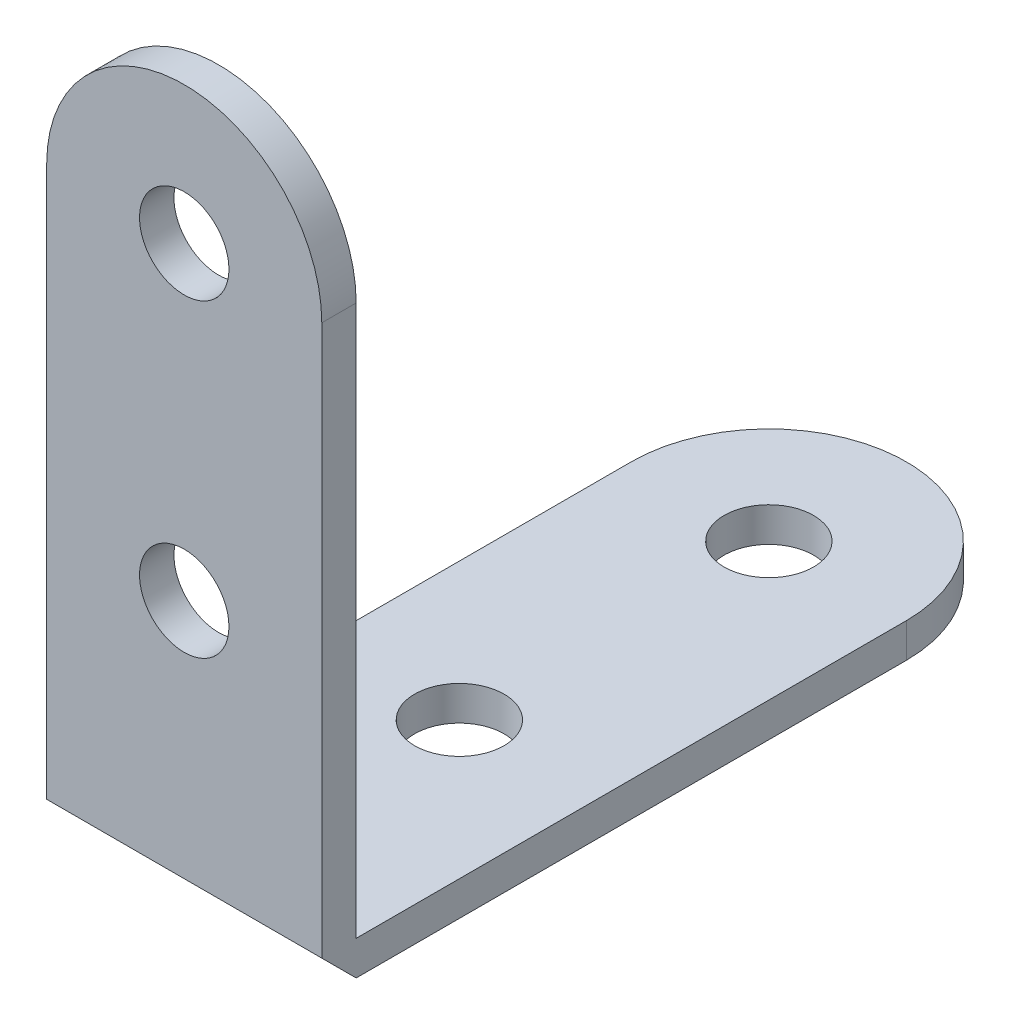
ISO-10303-21;
HEADER;
FILE_DESCRIPTION(('STEP AP214'),'2;1');
FILE_NAME('part.step','',(''),(''),'','','');
FILE_SCHEMA(('AUTOMOTIVE_DESIGN { 1 0 10303 214 1 1 1 1 }'));
ENDSEC;
DATA;
#1=APPLICATION_CONTEXT('core data for automotive mechanical design processes');
#2=APPLICATION_PROTOCOL_DEFINITION('international standard','automotive_design',2000,#1);
#3=PRODUCT_CONTEXT('',#1,'mechanical');
#4=PRODUCT('Part','Part','',(#3));
#5=PRODUCT_RELATED_PRODUCT_CATEGORY('part','',(#4));
#6=PRODUCT_DEFINITION_FORMATION('','',#4);
#7=PRODUCT_DEFINITION_CONTEXT('part definition',#1,'design');
#8=PRODUCT_DEFINITION('design','',#6,#7);
#9=PRODUCT_DEFINITION_SHAPE('','',#8);
#10=(LENGTH_UNIT() NAMED_UNIT(*) SI_UNIT(.MILLI.,.METRE.));
#11=(NAMED_UNIT(*) PLANE_ANGLE_UNIT() SI_UNIT($,.RADIAN.));
#12=(NAMED_UNIT(*) SI_UNIT($,.STERADIAN.) SOLID_ANGLE_UNIT());
#13=UNCERTAINTY_MEASURE_WITH_UNIT(LENGTH_MEASURE(1.E-05),#10,'distance_accuracy_value','');
#14=(GEOMETRIC_REPRESENTATION_CONTEXT(3) GLOBAL_UNCERTAINTY_ASSIGNED_CONTEXT((#13)) GLOBAL_UNIT_ASSIGNED_CONTEXT((#10,
#11,#12)) REPRESENTATION_CONTEXT('',''));
#15=CARTESIAN_POINT('',(0.,0.,0.));
#16=DIRECTION('',(0.,0.,1.));
#17=DIRECTION('',(1.,0.,0.));
#18=AXIS2_PLACEMENT_3D('',#15,#16,#17);
#19=CARTESIAN_POINT('',(0.,32.,0.));
#20=DIRECTION('',(0.,0.,1.));
#21=DIRECTION('',(1.,0.,0.));
#22=AXIS2_PLACEMENT_3D('',#19,#20,#21);
#23=PLANE('',#22);
#24=CARTESIAN_POINT('',(0.,14.,0.));
#25=DIRECTION('',(0.,0.,1.));
#26=DIRECTION('',(1.,0.,0.));
#27=AXIS2_PLACEMENT_3D('',#24,#25,#26);
#28=CIRCLE('',#27,2.6);
#29=CARTESIAN_POINT('',(2.6,14.,0.));
#30=VERTEX_POINT('',#29);
#31=EDGE_CURVE('E162',#30,#30,#28,.T.);
#32=ORIENTED_EDGE('',*,*,#31,.T.);
#33=EDGE_LOOP('',(#32));
#34=FACE_BOUND('',#33,.T.);
#35=CARTESIAN_POINT('',(0.,32.,0.));
#36=DIRECTION('',(0.,0.,1.));
#37=DIRECTION('',(1.,0.,0.));
#38=AXIS2_PLACEMENT_3D('',#35,#36,#37);
#39=CIRCLE('',#38,2.6);
#40=CARTESIAN_POINT('',(2.6,32.,0.));
#41=VERTEX_POINT('',#40);
#42=EDGE_CURVE('E167',#41,#41,#39,.T.);
#43=ORIENTED_EDGE('',*,*,#42,.T.);
#44=EDGE_LOOP('',(#43));
#45=FACE_BOUND('',#44,.T.);
#46=DIRECTION('',(1.,0.,0.));
#47=VECTOR('',#46,1.);
#48=CARTESIAN_POINT('',(-8.,0.,0.));
#49=LINE('',#48,#47);
#50=CARTESIAN_POINT('',(-8.,0.,0.));
#51=VERTEX_POINT('',#50);
#52=CARTESIAN_POINT('',(8.,0.,0.));
#53=VERTEX_POINT('',#52);
#54=EDGE_CURVE('E55',#51,#53,#49,.T.);
#55=ORIENTED_EDGE('',*,*,#54,.F.);
#56=DIRECTION('',(0.,-1.,0.));
#57=VECTOR('',#56,1.);
#58=CARTESIAN_POINT('',(-8.,32.,0.));
#59=LINE('',#58,#57);
#60=CARTESIAN_POINT('',(-8.,32.,0.));
#61=VERTEX_POINT('',#60);
#62=EDGE_CURVE('E192',#61,#51,#59,.T.);
#63=ORIENTED_EDGE('',*,*,#62,.F.);
#64=CARTESIAN_POINT('',(0.,32.,0.));
#65=DIRECTION('',(0.,0.,1.));
#66=DIRECTION('',(1.,0.,0.));
#67=AXIS2_PLACEMENT_3D('',#64,#65,#66);
#68=CIRCLE('',#67,8.);
#69=CARTESIAN_POINT('',(8.,32.,0.));
#70=VERTEX_POINT('',#69);
#71=EDGE_CURVE('E175',#70,#61,#68,.T.);
#72=ORIENTED_EDGE('',*,*,#71,.F.);
#73=DIRECTION('',(0.,1.,0.));
#74=VECTOR('',#73,1.);
#75=CARTESIAN_POINT('',(8.,0.,0.));
#76=LINE('',#75,#74);
#77=EDGE_CURVE('E77',#53,#70,#76,.T.);
#78=ORIENTED_EDGE('',*,*,#77,.F.);
#79=EDGE_LOOP('',(#55,#63,#72,#78));
#80=FACE_BOUND('',#79,.T.);
#81=ADVANCED_FACE('F39',(#34,#45,#80),#23,.F.);
#82=CARTESIAN_POINT('',(0.,32.,2.));
#83=DIRECTION('',(0.,0.,1.));
#84=DIRECTION('',(1.,0.,0.));
#85=AXIS2_PLACEMENT_3D('',#82,#83,#84);
#86=PLANE('',#85);
#87=CARTESIAN_POINT('',(0.,32.,2.));
#88=DIRECTION('',(0.,0.,1.));
#89=DIRECTION('',(1.,0.,0.));
#90=AXIS2_PLACEMENT_3D('',#87,#88,#89);
#91=CIRCLE('',#90,2.6);
#92=CARTESIAN_POINT('',(2.6,32.,2.));
#93=VERTEX_POINT('',#92);
#94=EDGE_CURVE('E171',#93,#93,#91,.T.);
#95=ORIENTED_EDGE('',*,*,#94,.F.);
#96=EDGE_LOOP('',(#95));
#97=FACE_BOUND('',#96,.T.);
#98=CARTESIAN_POINT('',(0.,32.,2.));
#99=DIRECTION('',(0.,0.,1.));
#100=DIRECTION('',(1.,0.,0.));
#101=AXIS2_PLACEMENT_3D('',#98,#99,#100);
#102=CIRCLE('',#101,8.);
#103=CARTESIAN_POINT('',(8.,32.,2.));
#104=VERTEX_POINT('',#103);
#105=CARTESIAN_POINT('',(-8.,32.,2.));
#106=VERTEX_POINT('',#105);
#107=EDGE_CURVE('E179',#104,#106,#102,.T.);
#108=ORIENTED_EDGE('',*,*,#107,.T.);
#109=DIRECTION('',(0.,-1.,0.));
#110=VECTOR('',#109,1.);
#111=CARTESIAN_POINT('',(-8.,32.,2.));
#112=LINE('',#111,#110);
#113=CARTESIAN_POINT('',(-8.,0.,2.));
#114=VERTEX_POINT('',#113);
#115=EDGE_CURVE('E84',#106,#114,#112,.T.);
#116=ORIENTED_EDGE('',*,*,#115,.T.);
#117=DIRECTION('',(1.,0.,0.));
#118=VECTOR('',#117,1.);
#119=CARTESIAN_POINT('',(-8.,0.,2.));
#120=LINE('',#119,#118);
#121=CARTESIAN_POINT('',(8.,0.,2.));
#122=VERTEX_POINT('',#121);
#123=EDGE_CURVE('E184',#114,#122,#120,.T.);
#124=ORIENTED_EDGE('',*,*,#123,.T.);
#125=DIRECTION('',(0.,1.,0.));
#126=VECTOR('',#125,1.);
#127=CARTESIAN_POINT('',(8.,0.,2.));
#128=LINE('',#127,#126);
#129=EDGE_CURVE('E64',#122,#104,#128,.T.);
#130=ORIENTED_EDGE('',*,*,#129,.T.);
#131=EDGE_LOOP('',(#108,#116,#124,#130));
#132=FACE_BOUND('',#131,.T.);
#133=CARTESIAN_POINT('',(0.,14.,2.));
#134=DIRECTION('',(0.,0.,1.));
#135=DIRECTION('',(1.,0.,0.));
#136=AXIS2_PLACEMENT_3D('',#133,#134,#135);
#137=CIRCLE('',#136,2.6);
#138=CARTESIAN_POINT('',(2.6,14.,2.));
#139=VERTEX_POINT('',#138);
#140=EDGE_CURVE('E163',#139,#139,#137,.T.);
#141=ORIENTED_EDGE('',*,*,#140,.F.);
#142=EDGE_LOOP('',(#141));
#143=FACE_BOUND('',#142,.T.);
#144=ADVANCED_FACE('F208',(#97,#132,#143),#86,.T.);
#145=CARTESIAN_POINT('',(0.,32.,2.));
#146=DIRECTION('',(0.,0.,-1.));
#147=DIRECTION('',(-1.,0.,0.));
#148=AXIS2_PLACEMENT_3D('',#145,#146,#147);
#149=CYLINDRICAL_SURFACE('',#148,8.);
#150=ORIENTED_EDGE('',*,*,#71,.T.);
#151=DIRECTION('',(0.,0.,-1.));
#152=VECTOR('',#151,1.);
#153=CARTESIAN_POINT('',(-8.,32.,2.));
#154=LINE('',#153,#152);
#155=EDGE_CURVE('E11',#106,#61,#154,.T.);
#156=ORIENTED_EDGE('',*,*,#155,.F.);
#157=ORIENTED_EDGE('',*,*,#107,.F.);
#158=DIRECTION('',(0.,0.,-1.));
#159=VECTOR('',#158,1.);
#160=CARTESIAN_POINT('',(8.,32.,2.));
#161=LINE('',#160,#159);
#162=EDGE_CURVE('E48',#104,#70,#161,.T.);
#163=ORIENTED_EDGE('',*,*,#162,.T.);
#164=EDGE_LOOP('',(#150,#156,#157,#163));
#165=FACE_BOUND('',#164,.T.);
#166=ADVANCED_FACE('F41',(#165),#149,.T.);
#167=CARTESIAN_POINT('',(-8.,32.,2.));
#168=DIRECTION('',(1.,0.,0.));
#169=DIRECTION('',(0.,0.,-1.));
#170=AXIS2_PLACEMENT_3D('',#167,#168,#169);
#171=PLANE('',#170);
#172=ORIENTED_EDGE('',*,*,#62,.T.);
#173=DIRECTION('',(0.,0.,1.));
#174=VECTOR('',#173,1.);
#175=CARTESIAN_POINT('',(-8.,0.,-32.));
#176=LINE('',#175,#174);
#177=CARTESIAN_POINT('',(-8.,0.,-32.));
#178=VERTEX_POINT('',#177);
#179=EDGE_CURVE('E111',#178,#51,#176,.T.);
#180=ORIENTED_EDGE('',*,*,#179,.F.);
#181=DIRECTION('',(0.,1.,0.));
#182=VECTOR('',#181,1.);
#183=CARTESIAN_POINT('',(-8.,-2.,-32.));
#184=LINE('',#183,#182);
#185=CARTESIAN_POINT('',(-8.,-2.,-32.));
#186=VERTEX_POINT('',#185);
#187=EDGE_CURVE('E106',#186,#178,#184,.T.);
#188=ORIENTED_EDGE('',*,*,#187,.F.);
#189=DIRECTION('',(0.,0.,1.));
#190=VECTOR('',#189,1.);
#191=CARTESIAN_POINT('',(-8.,-2.,-32.));
#192=LINE('',#191,#190);
#193=CARTESIAN_POINT('',(-8.,-2.,0.));
#194=VERTEX_POINT('',#193);
#195=EDGE_CURVE('E109',#186,#194,#192,.T.);
#196=ORIENTED_EDGE('',*,*,#195,.T.);
#197=DIRECTION('',(0.,0.707106781186548,0.707106781186548));
#198=VECTOR('',#197,1.);
#199=CARTESIAN_POINT('',(-8.,-2.,0.));
#200=LINE('',#199,#198);
#201=EDGE_CURVE('E159',#194,#114,#200,.T.);
#202=ORIENTED_EDGE('',*,*,#201,.T.);
#203=ORIENTED_EDGE('',*,*,#115,.F.);
#204=ORIENTED_EDGE('',*,*,#155,.T.);
#205=EDGE_LOOP('',(#172,#180,#188,#196,#202,#203,#204));
#206=FACE_BOUND('',#205,.T.);
#207=ADVANCED_FACE('F108',(#206),#171,.F.);
#208=CARTESIAN_POINT('',(8.,0.,2.));
#209=DIRECTION('',(-1.,0.,0.));
#210=DIRECTION('',(0.,0.,1.));
#211=AXIS2_PLACEMENT_3D('',#208,#209,#210);
#212=PLANE('',#211);
#213=DIRECTION('',(0.,-0.707106781186548,-0.707106781186548));
#214=VECTOR('',#213,1.);
#215=CARTESIAN_POINT('',(8.,-2.,0.));
#216=LINE('',#215,#214);
#217=CARTESIAN_POINT('',(8.,-2.,0.));
#218=VERTEX_POINT('',#217);
#219=EDGE_CURVE('E152',#122,#218,#216,.T.);
#220=ORIENTED_EDGE('',*,*,#219,.T.);
#221=DIRECTION('',(0.,0.,-1.));
#222=VECTOR('',#221,1.);
#223=CARTESIAN_POINT('',(8.,-2.,0.));
#224=LINE('',#223,#222);
#225=CARTESIAN_POINT('',(8.,-2.,-32.));
#226=VERTEX_POINT('',#225);
#227=EDGE_CURVE('E118',#218,#226,#224,.T.);
#228=ORIENTED_EDGE('',*,*,#227,.T.);
#229=DIRECTION('',(0.,1.,0.));
#230=VECTOR('',#229,1.);
#231=CARTESIAN_POINT('',(8.,-2.,-32.));
#232=LINE('',#231,#230);
#233=CARTESIAN_POINT('',(8.,0.,-32.));
#234=VERTEX_POINT('',#233);
#235=EDGE_CURVE('E117',#226,#234,#232,.T.);
#236=ORIENTED_EDGE('',*,*,#235,.T.);
#237=DIRECTION('',(0.,0.,-1.));
#238=VECTOR('',#237,1.);
#239=CARTESIAN_POINT('',(8.,0.,0.));
#240=LINE('',#239,#238);
#241=EDGE_CURVE('E132',#53,#234,#240,.T.);
#242=ORIENTED_EDGE('',*,*,#241,.F.);
#243=ORIENTED_EDGE('',*,*,#77,.T.);
#244=ORIENTED_EDGE('',*,*,#162,.F.);
#245=ORIENTED_EDGE('',*,*,#129,.F.);
#246=EDGE_LOOP('',(#220,#228,#236,#242,#243,#244,#245));
#247=FACE_BOUND('',#246,.T.);
#248=ADVANCED_FACE('F203',(#247),#212,.F.);
#249=CARTESIAN_POINT('',(0.,32.,2.));
#250=DIRECTION('',(0.,0.,-1.));
#251=DIRECTION('',(-1.,0.,0.));
#252=AXIS2_PLACEMENT_3D('',#249,#250,#251);
#253=CYLINDRICAL_SURFACE('',#252,2.6);
#254=ORIENTED_EDGE('',*,*,#94,.T.);
#255=EDGE_LOOP('',(#254));
#256=FACE_BOUND('',#255,.T.);
#257=ORIENTED_EDGE('',*,*,#42,.F.);
#258=EDGE_LOOP('',(#257));
#259=FACE_BOUND('',#258,.T.);
#260=ADVANCED_FACE('F218',(#256,#259),#253,.F.);
#261=CARTESIAN_POINT('',(0.,14.,2.));
#262=DIRECTION('',(0.,0.,-1.));
#263=DIRECTION('',(-1.,0.,0.));
#264=AXIS2_PLACEMENT_3D('',#261,#262,#263);
#265=CYLINDRICAL_SURFACE('',#264,2.6);
#266=ORIENTED_EDGE('',*,*,#140,.T.);
#267=EDGE_LOOP('',(#266));
#268=FACE_BOUND('',#267,.T.);
#269=ORIENTED_EDGE('',*,*,#31,.F.);
#270=EDGE_LOOP('',(#269));
#271=FACE_BOUND('',#270,.T.);
#272=ADVANCED_FACE('F215',(#268,#271),#265,.F.);
#273=CARTESIAN_POINT('',(-10.8284271247462,-2.,0.));
#274=DIRECTION('',(0.,-0.707106781186548,0.707106781186548));
#275=DIRECTION('',(0.,-0.707106781186548,-0.707106781186548));
#276=AXIS2_PLACEMENT_3D('',#273,#274,#275);
#277=PLANE('',#276);
#278=ORIENTED_EDGE('',*,*,#201,.F.);
#279=DIRECTION('',(1.,0.,0.));
#280=VECTOR('',#279,1.);
#281=CARTESIAN_POINT('',(-10.8284271247462,-2.,0.));
#282=LINE('',#281,#280);
#283=EDGE_CURVE('E127',#194,#218,#282,.T.);
#284=ORIENTED_EDGE('',*,*,#283,.T.);
#285=ORIENTED_EDGE('',*,*,#219,.F.);
#286=ORIENTED_EDGE('',*,*,#123,.F.);
#287=EDGE_LOOP('',(#278,#284,#285,#286));
#288=FACE_BOUND('',#287,.T.);
#289=ADVANCED_FACE('F207',(#288),#277,.T.);
#290=CARTESIAN_POINT('',(0.,-2.,-32.));
#291=DIRECTION('',(0.,1.,0.));
#292=DIRECTION('',(0.,0.,1.));
#293=AXIS2_PLACEMENT_3D('',#290,#291,#292);
#294=CYLINDRICAL_SURFACE('',#293,8.);
#295=CARTESIAN_POINT('',(0.,0.,-32.));
#296=DIRECTION('',(0.,1.,0.));
#297=DIRECTION('',(0.,0.,1.));
#298=AXIS2_PLACEMENT_3D('',#295,#296,#297);
#299=CIRCLE('',#298,8.);
#300=EDGE_CURVE('E143',#234,#178,#299,.T.);
#301=ORIENTED_EDGE('',*,*,#300,.F.);
#302=ORIENTED_EDGE('',*,*,#235,.F.);
#303=CARTESIAN_POINT('',(0.,-2.,-32.));
#304=DIRECTION('',(0.,1.,0.));
#305=DIRECTION('',(0.,0.,1.));
#306=AXIS2_PLACEMENT_3D('',#303,#304,#305);
#307=CIRCLE('',#306,8.);
#308=EDGE_CURVE('E125',#226,#186,#307,.T.);
#309=ORIENTED_EDGE('',*,*,#308,.T.);
#310=ORIENTED_EDGE('',*,*,#187,.T.);
#311=EDGE_LOOP('',(#301,#302,#309,#310));
#312=FACE_BOUND('',#311,.T.);
#313=ADVANCED_FACE('F130',(#312),#294,.T.);
#314=CARTESIAN_POINT('',(0.,-2.,-32.));
#315=DIRECTION('',(0.,1.,0.));
#316=DIRECTION('',(0.,0.,1.));
#317=AXIS2_PLACEMENT_3D('',#314,#315,#316);
#318=PLANE('',#317);
#319=CARTESIAN_POINT('',(0.,-2.,-14.));
#320=DIRECTION('',(0.,1.,0.));
#321=DIRECTION('',(0.,0.,1.));
#322=AXIS2_PLACEMENT_3D('',#319,#320,#321);
#323=CIRCLE('',#322,2.6);
#324=CARTESIAN_POINT('',(0.,-2.,-11.4));
#325=VERTEX_POINT('',#324);
#326=EDGE_CURVE('E348',#325,#325,#323,.T.);
#327=ORIENTED_EDGE('',*,*,#326,.T.);
#328=EDGE_LOOP('',(#327));
#329=FACE_BOUND('',#328,.T.);
#330=CARTESIAN_POINT('',(0.,-2.,-32.));
#331=DIRECTION('',(0.,1.,0.));
#332=DIRECTION('',(0.,0.,1.));
#333=AXIS2_PLACEMENT_3D('',#330,#331,#332);
#334=CIRCLE('',#333,2.6);
#335=CARTESIAN_POINT('',(0.,-2.,-29.4));
#336=VERTEX_POINT('',#335);
#337=EDGE_CURVE('E146',#336,#336,#334,.T.);
#338=ORIENTED_EDGE('',*,*,#337,.T.);
#339=EDGE_LOOP('',(#338));
#340=FACE_BOUND('',#339,.T.);
#341=ORIENTED_EDGE('',*,*,#308,.F.);
#342=ORIENTED_EDGE('',*,*,#227,.F.);
#343=ORIENTED_EDGE('',*,*,#283,.F.);
#344=ORIENTED_EDGE('',*,*,#195,.F.);
#345=EDGE_LOOP('',(#341,#342,#343,#344));
#346=FACE_BOUND('',#345,.T.);
#347=ADVANCED_FACE('F123',(#329,#340,#346),#318,.F.);
#348=CARTESIAN_POINT('',(0.,0.,-32.));
#349=DIRECTION('',(0.,1.,0.));
#350=DIRECTION('',(0.,0.,1.));
#351=AXIS2_PLACEMENT_3D('',#348,#349,#350);
#352=PLANE('',#351);
#353=CARTESIAN_POINT('',(0.,0.,-14.));
#354=DIRECTION('',(0.,1.,0.));
#355=DIRECTION('',(0.,0.,1.));
#356=AXIS2_PLACEMENT_3D('',#353,#354,#355);
#357=CIRCLE('',#356,2.6);
#358=CARTESIAN_POINT('',(0.,0.,-11.4));
#359=VERTEX_POINT('',#358);
#360=EDGE_CURVE('E355',#359,#359,#357,.T.);
#361=ORIENTED_EDGE('',*,*,#360,.F.);
#362=EDGE_LOOP('',(#361));
#363=FACE_BOUND('',#362,.T.);
#364=CARTESIAN_POINT('',(0.,0.,-32.));
#365=DIRECTION('',(0.,1.,0.));
#366=DIRECTION('',(0.,0.,1.));
#367=AXIS2_PLACEMENT_3D('',#364,#365,#366);
#368=CIRCLE('',#367,2.6);
#369=CARTESIAN_POINT('',(0.,0.,-29.4));
#370=VERTEX_POINT('',#369);
#371=EDGE_CURVE('E138',#370,#370,#368,.T.);
#372=ORIENTED_EDGE('',*,*,#371,.F.);
#373=EDGE_LOOP('',(#372));
#374=FACE_BOUND('',#373,.T.);
#375=ORIENTED_EDGE('',*,*,#300,.T.);
#376=ORIENTED_EDGE('',*,*,#179,.T.);
#377=ORIENTED_EDGE('',*,*,#54,.T.);
#378=ORIENTED_EDGE('',*,*,#241,.T.);
#379=EDGE_LOOP('',(#375,#376,#377,#378));
#380=FACE_BOUND('',#379,.T.);
#381=ADVANCED_FACE('F202',(#363,#374,#380),#352,.T.);
#382=CARTESIAN_POINT('',(0.,-2.,-32.));
#383=DIRECTION('',(0.,1.,0.));
#384=DIRECTION('',(0.,0.,1.));
#385=AXIS2_PLACEMENT_3D('',#382,#383,#384);
#386=CYLINDRICAL_SURFACE('',#385,2.6);
#387=ORIENTED_EDGE('',*,*,#337,.F.);
#388=EDGE_LOOP('',(#387));
#389=FACE_BOUND('',#388,.T.);
#390=ORIENTED_EDGE('',*,*,#371,.T.);
#391=EDGE_LOOP('',(#390));
#392=FACE_BOUND('',#391,.T.);
#393=ADVANCED_FACE('F292',(#389,#392),#386,.F.);
#394=CARTESIAN_POINT('',(0.,-2.,-14.));
#395=DIRECTION('',(0.,1.,0.));
#396=DIRECTION('',(0.,0.,1.));
#397=AXIS2_PLACEMENT_3D('',#394,#395,#396);
#398=CYLINDRICAL_SURFACE('',#397,2.6);
#399=ORIENTED_EDGE('',*,*,#326,.F.);
#400=EDGE_LOOP('',(#399));
#401=FACE_BOUND('',#400,.T.);
#402=ORIENTED_EDGE('',*,*,#360,.T.);
#403=EDGE_LOOP('',(#402));
#404=FACE_BOUND('',#403,.T.);
#405=ADVANCED_FACE('F286',(#401,#404),#398,.F.);
#406=CLOSED_SHELL('',(#81,#144,#166,#207,#248,#260,#272,#289,#313,#347,#381,#393,#405));
#407=MANIFOLD_SOLID_BREP('B2',#406);
#408=ADVANCED_BREP_SHAPE_REPRESENTATION('',(#18,#407),#14);
#409=SHAPE_DEFINITION_REPRESENTATION(#9,#408);
ENDSEC;
END-ISO-10303-21;
